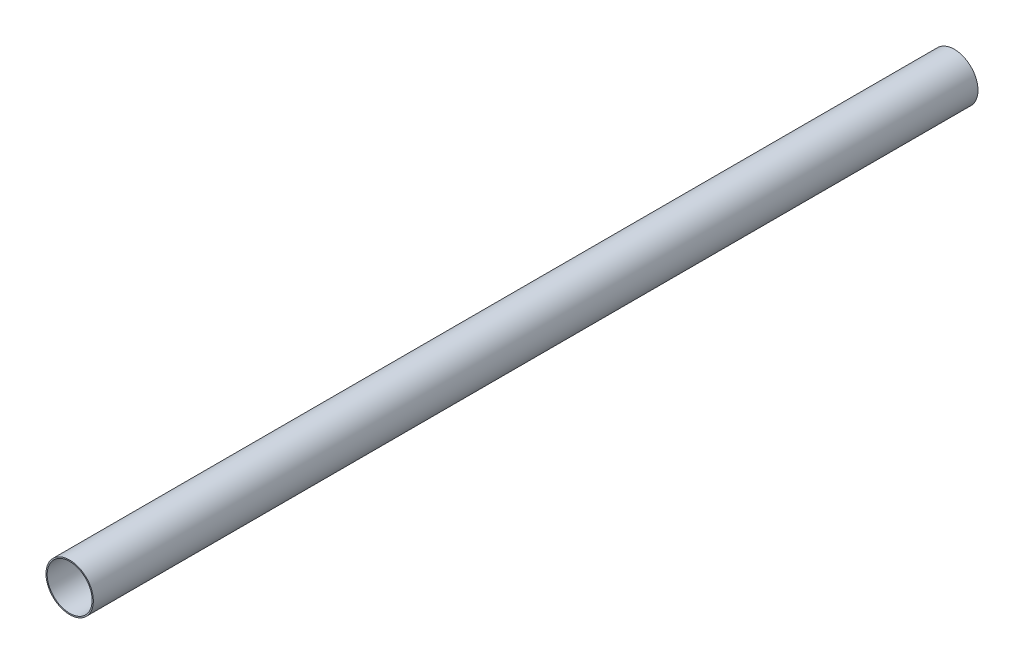
ISO-10303-21;
HEADER;
FILE_DESCRIPTION(('STEP AP214'),'2;1');
FILE_NAME('part.step','',(''),(''),'','','');
FILE_SCHEMA(('AUTOMOTIVE_DESIGN { 1 0 10303 214 1 1 1 1 }'));
ENDSEC;
DATA;
#1=APPLICATION_CONTEXT('core data for automotive mechanical design processes');
#2=APPLICATION_PROTOCOL_DEFINITION('international standard','automotive_design',2000,#1);
#3=PRODUCT_CONTEXT('',#1,'mechanical');
#4=PRODUCT('Part','Part','',(#3));
#5=PRODUCT_RELATED_PRODUCT_CATEGORY('part','',(#4));
#6=PRODUCT_DEFINITION_FORMATION('','',#4);
#7=PRODUCT_DEFINITION_CONTEXT('part definition',#1,'design');
#8=PRODUCT_DEFINITION('design','',#6,#7);
#9=PRODUCT_DEFINITION_SHAPE('','',#8);
#10=(LENGTH_UNIT() NAMED_UNIT(*) SI_UNIT(.MILLI.,.METRE.));
#11=(NAMED_UNIT(*) PLANE_ANGLE_UNIT() SI_UNIT($,.RADIAN.));
#12=(NAMED_UNIT(*) SI_UNIT($,.STERADIAN.) SOLID_ANGLE_UNIT());
#13=UNCERTAINTY_MEASURE_WITH_UNIT(LENGTH_MEASURE(1.E-05),#10,'distance_accuracy_value','');
#14=(GEOMETRIC_REPRESENTATION_CONTEXT(3) GLOBAL_UNCERTAINTY_ASSIGNED_CONTEXT((#13)) GLOBAL_UNIT_ASSIGNED_CONTEXT((#10,
#11,#12)) REPRESENTATION_CONTEXT('',''));
#15=CARTESIAN_POINT('',(0.,0.,0.));
#16=DIRECTION('',(0.,0.,1.));
#17=DIRECTION('',(1.,0.,0.));
#18=AXIS2_PLACEMENT_3D('',#15,#16,#17);
#19=CARTESIAN_POINT('',(0.,0.,1400.));
#20=DIRECTION('',(0.,0.,-1.));
#21=DIRECTION('',(-1.,0.,0.));
#22=AXIS2_PLACEMENT_3D('',#19,#20,#21);
#23=CYLINDRICAL_SURFACE('',#22,37.5);
#24=CARTESIAN_POINT('',(0.,0.,1400.));
#25=DIRECTION('',(0.,0.,1.));
#26=DIRECTION('',(1.,0.,0.));
#27=AXIS2_PLACEMENT_3D('',#24,#25,#26);
#28=CIRCLE('',#27,37.5);
#29=CARTESIAN_POINT('',(37.5,0.,1400.));
#30=VERTEX_POINT('',#29);
#31=EDGE_CURVE('E10',#30,#30,#28,.T.);
#32=ORIENTED_EDGE('',*,*,#31,.F.);
#33=EDGE_LOOP('',(#32));
#34=FACE_BOUND('',#33,.T.);
#35=CARTESIAN_POINT('',(0.,0.,0.));
#36=DIRECTION('',(0.,0.,1.));
#37=DIRECTION('',(1.,0.,0.));
#38=AXIS2_PLACEMENT_3D('',#35,#36,#37);
#39=CIRCLE('',#38,37.5);
#40=CARTESIAN_POINT('',(37.5,0.,0.));
#41=VERTEX_POINT('',#40);
#42=EDGE_CURVE('E40',#41,#41,#39,.T.);
#43=ORIENTED_EDGE('',*,*,#42,.T.);
#44=EDGE_LOOP('',(#43));
#45=FACE_BOUND('',#44,.T.);
#46=ADVANCED_FACE('F37',(#34,#45),#23,.T.);
#47=CARTESIAN_POINT('',(0.,0.,1400.));
#48=DIRECTION('',(0.,0.,1.));
#49=DIRECTION('',(1.,0.,0.));
#50=AXIS2_PLACEMENT_3D('',#47,#48,#49);
#51=PLANE('',#50);
#52=CARTESIAN_POINT('',(0.,0.,1400.));
#53=DIRECTION('',(0.,0.,1.));
#54=DIRECTION('',(1.,0.,0.));
#55=AXIS2_PLACEMENT_3D('',#52,#53,#54);
#56=CIRCLE('',#55,35.6);
#57=CARTESIAN_POINT('',(35.6,0.,1400.));
#58=VERTEX_POINT('',#57);
#59=EDGE_CURVE('E49',#58,#58,#56,.T.);
#60=ORIENTED_EDGE('',*,*,#59,.F.);
#61=EDGE_LOOP('',(#60));
#62=FACE_BOUND('',#61,.T.);
#63=ORIENTED_EDGE('',*,*,#31,.T.);
#64=EDGE_LOOP('',(#63));
#65=FACE_BOUND('',#64,.T.);
#66=ADVANCED_FACE('F62',(#62,#65),#51,.T.);
#67=CARTESIAN_POINT('',(0.,0.,0.));
#68=DIRECTION('',(0.,0.,1.));
#69=DIRECTION('',(1.,0.,0.));
#70=AXIS2_PLACEMENT_3D('',#67,#68,#69);
#71=PLANE('',#70);
#72=CARTESIAN_POINT('',(0.,0.,0.));
#73=DIRECTION('',(0.,0.,1.));
#74=DIRECTION('',(1.,0.,0.));
#75=AXIS2_PLACEMENT_3D('',#72,#73,#74);
#76=CIRCLE('',#75,35.6);
#77=CARTESIAN_POINT('',(35.6,0.,0.));
#78=VERTEX_POINT('',#77);
#79=EDGE_CURVE('E51',#78,#78,#76,.T.);
#80=ORIENTED_EDGE('',*,*,#79,.T.);
#81=EDGE_LOOP('',(#80));
#82=FACE_BOUND('',#81,.T.);
#83=ORIENTED_EDGE('',*,*,#42,.F.);
#84=EDGE_LOOP('',(#83));
#85=FACE_BOUND('',#84,.T.);
#86=ADVANCED_FACE('F64',(#82,#85),#71,.F.);
#87=CARTESIAN_POINT('',(0.,0.,1400.));
#88=DIRECTION('',(0.,0.,-1.));
#89=DIRECTION('',(-1.,0.,0.));
#90=AXIS2_PLACEMENT_3D('',#87,#88,#89);
#91=CYLINDRICAL_SURFACE('',#90,35.6);
#92=ORIENTED_EDGE('',*,*,#59,.T.);
#93=EDGE_LOOP('',(#92));
#94=FACE_BOUND('',#93,.T.);
#95=ORIENTED_EDGE('',*,*,#79,.F.);
#96=EDGE_LOOP('',(#95));
#97=FACE_BOUND('',#96,.T.);
#98=ADVANCED_FACE('F59',(#94,#97),#91,.F.);
#99=CLOSED_SHELL('',(#46,#66,#86,#98));
#100=MANIFOLD_SOLID_BREP('B2',#99);
#101=ADVANCED_BREP_SHAPE_REPRESENTATION('',(#18,#100),#14);
#102=SHAPE_DEFINITION_REPRESENTATION(#9,#101);
ENDSEC;
END-ISO-10303-21;
